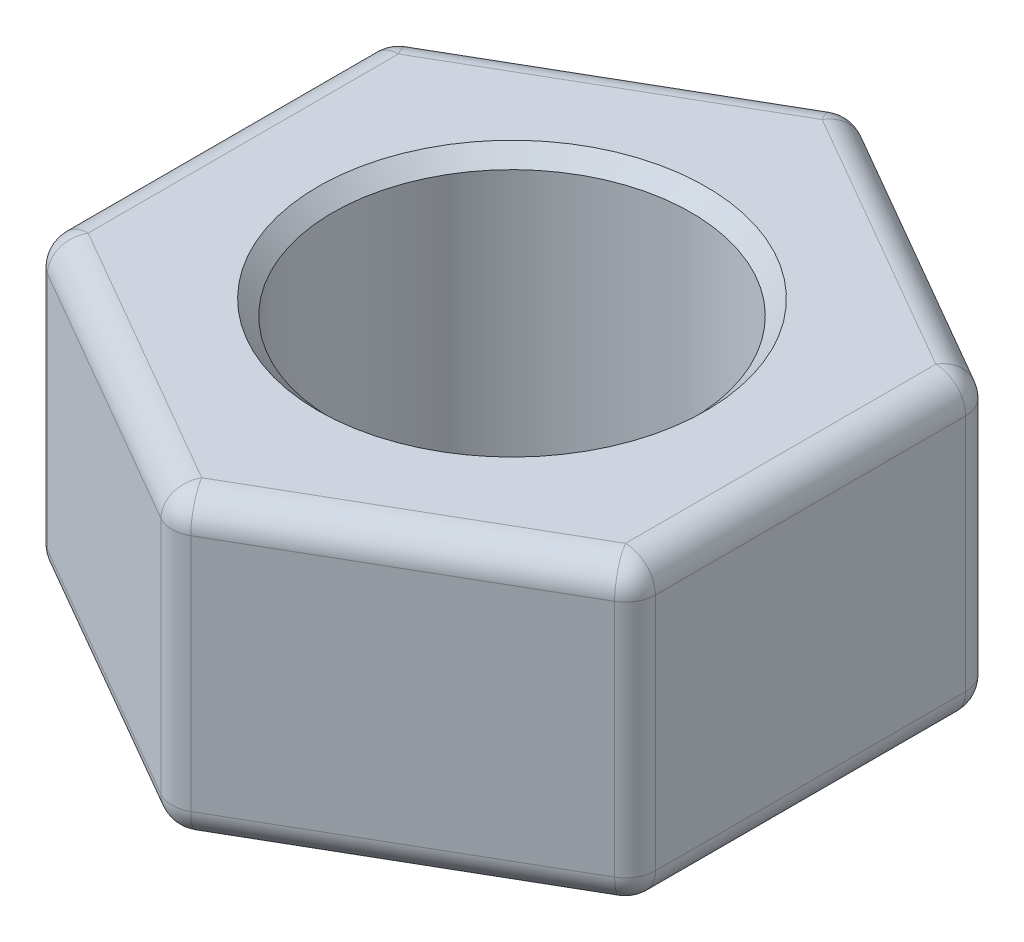
ISO-10303-21;
HEADER;
FILE_DESCRIPTION(('STEP AP214'),'2;1');
FILE_NAME('part.step','',(''),(''),'','','');
FILE_SCHEMA(('AUTOMOTIVE_DESIGN { 1 0 10303 214 1 1 1 1 }'));
ENDSEC;
DATA;
#1=APPLICATION_CONTEXT('core data for automotive mechanical design processes');
#2=APPLICATION_PROTOCOL_DEFINITION('international standard','automotive_design',2000,#1);
#3=PRODUCT_CONTEXT('',#1,'mechanical');
#4=PRODUCT('Part','Part','',(#3));
#5=PRODUCT_RELATED_PRODUCT_CATEGORY('part','',(#4));
#6=PRODUCT_DEFINITION_FORMATION('','',#4);
#7=PRODUCT_DEFINITION_CONTEXT('part definition',#1,'design');
#8=PRODUCT_DEFINITION('design','',#6,#7);
#9=PRODUCT_DEFINITION_SHAPE('','',#8);
#10=(LENGTH_UNIT() NAMED_UNIT(*) SI_UNIT(.MILLI.,.METRE.));
#11=(NAMED_UNIT(*) PLANE_ANGLE_UNIT() SI_UNIT($,.RADIAN.));
#12=(NAMED_UNIT(*) SI_UNIT($,.STERADIAN.) SOLID_ANGLE_UNIT());
#13=UNCERTAINTY_MEASURE_WITH_UNIT(LENGTH_MEASURE(1.E-05),#10,'distance_accuracy_value','');
#14=(GEOMETRIC_REPRESENTATION_CONTEXT(3) GLOBAL_UNCERTAINTY_ASSIGNED_CONTEXT((#13)) GLOBAL_UNIT_ASSIGNED_CONTEXT((#10,
#11,#12)) REPRESENTATION_CONTEXT('',''));
#15=CARTESIAN_POINT('',(0.,0.,0.));
#16=DIRECTION('',(0.,0.,1.));
#17=DIRECTION('',(1.,0.,0.));
#18=AXIS2_PLACEMENT_3D('',#15,#16,#17);
#19=CARTESIAN_POINT('',(0.,5.,0.));
#20=DIRECTION('',(0.,1.,0.));
#21=DIRECTION('',(0.,0.,1.));
#22=AXIS2_PLACEMENT_3D('',#19,#20,#21);
#23=PLANE('',#22);
#24=CARTESIAN_POINT('',(0.,5.,0.));
#25=DIRECTION('',(0.,1.,0.));
#26=DIRECTION('',(0.,0.,1.));
#27=AXIS2_PLACEMENT_3D('',#24,#25,#26);
#28=CIRCLE('',#27,3.25);
#29=CARTESIAN_POINT('',(0.,5.,3.25));
#30=VERTEX_POINT('',#29);
#31=EDGE_CURVE('E11',#30,#30,#28,.F.);
#32=ORIENTED_EDGE('',*,*,#31,.T.);
#33=EDGE_LOOP('',(#32));
#34=FACE_BOUND('',#33,.T.);
#35=DIRECTION('',(-0.866025403784438,0.,0.500000000000001));
#36=VECTOR('',#35,1.);
#37=CARTESIAN_POINT('',(-4.75,5.,-2.45373864405589));
#38=LINE('',#37,#36);
#39=CARTESIAN_POINT('',(0.,5.,-5.19615242270662));
#40=VERTEX_POINT('',#39);
#41=CARTESIAN_POINT('',(-4.5,5.,-2.5980762113533));
#42=VERTEX_POINT('',#41);
#43=EDGE_CURVE('E333',#40,#42,#38,.T.);
#44=ORIENTED_EDGE('',*,*,#43,.T.);
#45=DIRECTION('',(0.,0.,1.));
#46=VECTOR('',#45,1.);
#47=CARTESIAN_POINT('',(-4.49999999999998,5.,2.88675134594815));
#48=LINE('',#47,#46);
#49=CARTESIAN_POINT('',(-4.49999999999998,5.,2.59807621135333));
#50=VERTEX_POINT('',#49);
#51=EDGE_CURVE('E163',#42,#50,#48,.T.);
#52=ORIENTED_EDGE('',*,*,#51,.T.);
#53=DIRECTION('',(0.866025403784442,0.,0.499999999999995));
#54=VECTOR('',#53,1.);
#55=CARTESIAN_POINT('',(0.250000000000038,5.,5.34048999000403));
#56=LINE('',#55,#54);
#57=CARTESIAN_POINT('',(0.,5.,5.19615242270662));
#58=VERTEX_POINT('',#57);
#59=EDGE_CURVE('E158',#50,#58,#56,.T.);
#60=ORIENTED_EDGE('',*,*,#59,.T.);
#61=DIRECTION('',(0.866025403784435,0.,-0.500000000000007));
#62=VECTOR('',#61,1.);
#63=CARTESIAN_POINT('',(4.75000000000002,5.,2.45373864405586));
#64=LINE('',#63,#62);
#65=CARTESIAN_POINT('',(4.50000000000002,5.,2.59807621135327));
#66=VERTEX_POINT('',#65);
#67=EDGE_CURVE('E160',#58,#66,#64,.T.);
#68=ORIENTED_EDGE('',*,*,#67,.T.);
#69=DIRECTION('',(0.,0.,-1.));
#70=VECTOR('',#69,1.);
#71=CARTESIAN_POINT('',(4.49999999999996,5.,-2.88675134594818));
#72=LINE('',#71,#70);
#73=CARTESIAN_POINT('',(4.49999999999996,5.,-2.59807621135337));
#74=VERTEX_POINT('',#73);
#75=EDGE_CURVE('E167',#66,#74,#72,.T.);
#76=ORIENTED_EDGE('',*,*,#75,.T.);
#77=DIRECTION('',(-0.866025403784442,0.,-0.499999999999995));
#78=VECTOR('',#77,1.);
#79=CARTESIAN_POINT('',(-0.249999999999997,5.,-5.34048999000403));
#80=LINE('',#79,#78);
#81=EDGE_CURVE('E464',#74,#40,#80,.T.);
#82=ORIENTED_EDGE('',*,*,#81,.T.);
#83=EDGE_LOOP('',(#44,#52,#60,#68,#76,#82));
#84=FACE_BOUND('',#83,.T.);
#85=ADVANCED_FACE('F33',(#34,#84),#23,.T.);
#86=CARTESIAN_POINT('',(0.,0.,0.));
#87=DIRECTION('',(0.,1.,0.));
#88=DIRECTION('',(0.,0.,1.));
#89=AXIS2_PLACEMENT_3D('',#86,#87,#88);
#90=PLANE('',#89);
#91=CARTESIAN_POINT('',(0.,0.,0.));
#92=DIRECTION('',(0.,1.,0.));
#93=DIRECTION('',(0.,0.,1.));
#94=AXIS2_PLACEMENT_3D('',#91,#92,#93);
#95=CIRCLE('',#94,3.25);
#96=CARTESIAN_POINT('',(0.,0.,3.25));
#97=VERTEX_POINT('',#96);
#98=EDGE_CURVE('E267',#97,#97,#95,.T.);
#99=ORIENTED_EDGE('',*,*,#98,.T.);
#100=EDGE_LOOP('',(#99));
#101=FACE_BOUND('',#100,.T.);
#102=DIRECTION('',(0.866025403784442,0.,0.499999999999995));
#103=VECTOR('',#102,1.);
#104=CARTESIAN_POINT('',(-2.24999999999997,0.,3.89711431702998));
#105=LINE('',#104,#103);
#106=CARTESIAN_POINT('',(0.,0.,5.19615242270662));
#107=VERTEX_POINT('',#106);
#108=CARTESIAN_POINT('',(-4.49999999999998,0.,2.59807621135333));
#109=VERTEX_POINT('',#108);
#110=EDGE_CURVE('E292',#107,#109,#105,.F.);
#111=ORIENTED_EDGE('',*,*,#110,.T.);
#112=DIRECTION('',(0.,0.,1.));
#113=VECTOR('',#112,1.);
#114=CARTESIAN_POINT('',(-4.49999999999999,0.,0.));
#115=LINE('',#114,#113);
#116=CARTESIAN_POINT('',(-4.5,0.,-2.5980762113533));
#117=VERTEX_POINT('',#116);
#118=EDGE_CURVE('E294',#109,#117,#115,.F.);
#119=ORIENTED_EDGE('',*,*,#118,.T.);
#120=DIRECTION('',(-0.866025403784438,0.,0.500000000000001));
#121=VECTOR('',#120,1.);
#122=CARTESIAN_POINT('',(-2.25,0.,-3.89711431702996));
#123=LINE('',#122,#121);
#124=CARTESIAN_POINT('',(0.,0.,-5.19615242270662));
#125=VERTEX_POINT('',#124);
#126=EDGE_CURVE('E310',#117,#125,#123,.F.);
#127=ORIENTED_EDGE('',*,*,#126,.T.);
#128=DIRECTION('',(-0.866025403784442,0.,-0.499999999999995));
#129=VECTOR('',#128,1.);
#130=CARTESIAN_POINT('',(2.24999999999998,0.,-3.89711431703));
#131=LINE('',#130,#129);
#132=CARTESIAN_POINT('',(4.49999999999996,0.,-2.59807621135337));
#133=VERTEX_POINT('',#132);
#134=EDGE_CURVE('E342',#125,#133,#131,.F.);
#135=ORIENTED_EDGE('',*,*,#134,.T.);
#136=DIRECTION('',(0.,0.,-1.));
#137=VECTOR('',#136,1.);
#138=CARTESIAN_POINT('',(4.49999999999999,0.,0.));
#139=LINE('',#138,#137);
#140=CARTESIAN_POINT('',(4.50000000000002,0.,2.59807621135327));
#141=VERTEX_POINT('',#140);
#142=EDGE_CURVE('E300',#133,#141,#139,.F.);
#143=ORIENTED_EDGE('',*,*,#142,.T.);
#144=DIRECTION('',(0.866025403784435,0.,-0.500000000000007));
#145=VECTOR('',#144,1.);
#146=CARTESIAN_POINT('',(2.25000000000003,0.,3.89711431702995));
#147=LINE('',#146,#145);
#148=EDGE_CURVE('E296',#141,#107,#147,.F.);
#149=ORIENTED_EDGE('',*,*,#148,.T.);
#150=EDGE_LOOP('',(#111,#119,#127,#135,#143,#149));
#151=FACE_BOUND('',#150,.T.);
#152=ADVANCED_FACE('F285',(#101,#151),#90,.F.);
#153=CARTESIAN_POINT('',(4.99999999999996,5.,-2.88675134594818));
#154=DIRECTION('',(-0.499999999999995,0.,0.866025403784442));
#155=DIRECTION('',(0.866025403784442,0.,0.499999999999995));
#156=AXIS2_PLACEMENT_3D('',#153,#154,#155);
#157=PLANE('',#156);
#158=DIRECTION('',(0.,-1.,0.));
#159=VECTOR('',#158,1.);
#160=CARTESIAN_POINT('',(0.249999999999999,5.,-5.62916512459884));
#161=LINE('',#160,#159);
#162=CARTESIAN_POINT('',(0.249999999999999,0.5,-5.62916512459884));
#163=VERTEX_POINT('',#162);
#164=CARTESIAN_POINT('',(0.249999999999999,4.5,-5.62916512459884));
#165=VERTEX_POINT('',#164);
#166=EDGE_CURVE('E357',#163,#165,#161,.F.);
#167=ORIENTED_EDGE('',*,*,#166,.T.);
#168=DIRECTION('',(-0.866025403784442,0.,-0.499999999999995));
#169=VECTOR('',#168,1.);
#170=CARTESIAN_POINT('',(4.99999999999996,4.5,-2.88675134594818));
#171=LINE('',#170,#169);
#172=CARTESIAN_POINT('',(4.74999999999996,4.5,-3.03108891324559));
#173=VERTEX_POINT('',#172);
#174=EDGE_CURVE('E359',#165,#173,#171,.F.);
#175=ORIENTED_EDGE('',*,*,#174,.T.);
#176=DIRECTION('',(0.,-1.,0.));
#177=VECTOR('',#176,1.);
#178=CARTESIAN_POINT('',(4.74999999999996,5.,-3.03108891324559));
#179=LINE('',#178,#177);
#180=CARTESIAN_POINT('',(4.74999999999996,0.5,-3.03108891324559));
#181=VERTEX_POINT('',#180);
#182=EDGE_CURVE('E353',#173,#181,#179,.T.);
#183=ORIENTED_EDGE('',*,*,#182,.T.);
#184=DIRECTION('',(-0.866025403784442,0.,-0.499999999999995));
#185=VECTOR('',#184,1.);
#186=CARTESIAN_POINT('',(4.99999999999996,0.5,-2.88675134594818));
#187=LINE('',#186,#185);
#188=EDGE_CURVE('E355',#181,#163,#187,.T.);
#189=ORIENTED_EDGE('',*,*,#188,.T.);
#190=EDGE_LOOP('',(#167,#175,#183,#189));
#191=FACE_BOUND('',#190,.T.);
#192=ADVANCED_FACE('F288',(#191),#157,.F.);
#193=CARTESIAN_POINT('',(0.,5.,-5.77350269189625));
#194=DIRECTION('',(0.500000000000001,0.,0.866025403784438));
#195=DIRECTION('',(0.866025403784438,0.,-0.500000000000001));
#196=AXIS2_PLACEMENT_3D('',#193,#194,#195);
#197=PLANE('',#196);
#198=DIRECTION('',(0.,-1.,0.));
#199=VECTOR('',#198,1.);
#200=CARTESIAN_POINT('',(-4.75,5.,-3.03108891324552));
#201=LINE('',#200,#199);
#202=CARTESIAN_POINT('',(-4.75,0.5,-3.03108891324552));
#203=VERTEX_POINT('',#202);
#204=CARTESIAN_POINT('',(-4.75,4.5,-3.03108891324552));
#205=VERTEX_POINT('',#204);
#206=EDGE_CURVE('E348',#203,#205,#201,.F.);
#207=ORIENTED_EDGE('',*,*,#206,.T.);
#208=DIRECTION('',(-0.866025403784438,0.,0.500000000000001));
#209=VECTOR('',#208,1.);
#210=CARTESIAN_POINT('',(0.,4.5,-5.77350269189625));
#211=LINE('',#210,#209);
#212=CARTESIAN_POINT('',(-0.249999999999998,4.5,-5.62916512459884));
#213=VERTEX_POINT('',#212);
#214=EDGE_CURVE('E350',#205,#213,#211,.F.);
#215=ORIENTED_EDGE('',*,*,#214,.T.);
#216=DIRECTION('',(0.,-1.,0.));
#217=VECTOR('',#216,1.);
#218=CARTESIAN_POINT('',(-0.249999999999998,5.,-5.62916512459884));
#219=LINE('',#218,#217);
#220=CARTESIAN_POINT('',(-0.249999999999998,0.5,-5.62916512459884));
#221=VERTEX_POINT('',#220);
#222=EDGE_CURVE('E309',#213,#221,#219,.T.);
#223=ORIENTED_EDGE('',*,*,#222,.T.);
#224=DIRECTION('',(-0.866025403784438,0.,0.500000000000001));
#225=VECTOR('',#224,1.);
#226=CARTESIAN_POINT('',(0.,0.5,-5.77350269189625));
#227=LINE('',#226,#225);
#228=EDGE_CURVE('E346',#221,#203,#227,.T.);
#229=ORIENTED_EDGE('',*,*,#228,.T.);
#230=EDGE_LOOP('',(#207,#215,#223,#229));
#231=FACE_BOUND('',#230,.T.);
#232=ADVANCED_FACE('F436',(#231),#197,.F.);
#233=CARTESIAN_POINT('',(-5.,5.,-2.88675134594811));
#234=DIRECTION('',(1.,0.,0.));
#235=DIRECTION('',(0.,0.,-1.));
#236=AXIS2_PLACEMENT_3D('',#233,#234,#235);
#237=PLANE('',#236);
#238=DIRECTION('',(0.,0.,1.));
#239=VECTOR('',#238,1.);
#240=CARTESIAN_POINT('',(-5.,4.5,-2.88675134594811));
#241=LINE('',#240,#239);
#242=CARTESIAN_POINT('',(-4.99999999999998,4.5,2.59807621135333));
#243=VERTEX_POINT('',#242);
#244=CARTESIAN_POINT('',(-5.,4.5,-2.5980762113533));
#245=VERTEX_POINT('',#244);
#246=EDGE_CURVE('E331',#243,#245,#241,.F.);
#247=ORIENTED_EDGE('',*,*,#246,.T.);
#248=DIRECTION('',(0.,-1.,0.));
#249=VECTOR('',#248,1.);
#250=CARTESIAN_POINT('',(-5.,5.,-2.5980762113533));
#251=LINE('',#250,#249);
#252=CARTESIAN_POINT('',(-5.,0.5,-2.5980762113533));
#253=VERTEX_POINT('',#252);
#254=EDGE_CURVE('E338',#245,#253,#251,.T.);
#255=ORIENTED_EDGE('',*,*,#254,.T.);
#256=DIRECTION('',(0.,0.,1.));
#257=VECTOR('',#256,1.);
#258=CARTESIAN_POINT('',(-5.,0.5,-2.88675134594811));
#259=LINE('',#258,#257);
#260=CARTESIAN_POINT('',(-4.99999999999998,0.5,2.59807621135333));
#261=VERTEX_POINT('',#260);
#262=EDGE_CURVE('E329',#253,#261,#259,.T.);
#263=ORIENTED_EDGE('',*,*,#262,.T.);
#264=DIRECTION('',(0.,-1.,0.));
#265=VECTOR('',#264,1.);
#266=CARTESIAN_POINT('',(-4.99999999999998,5.,2.59807621135333));
#267=LINE('',#266,#265);
#268=EDGE_CURVE('E322',#261,#243,#267,.F.);
#269=ORIENTED_EDGE('',*,*,#268,.T.);
#270=EDGE_LOOP('',(#247,#255,#263,#269));
#271=FACE_BOUND('',#270,.T.);
#272=ADVANCED_FACE('F403',(#271),#237,.F.);
#273=CARTESIAN_POINT('',(-4.99999999999998,5.,2.88675134594815));
#274=DIRECTION('',(0.499999999999995,0.,-0.866025403784442));
#275=DIRECTION('',(-0.866025403784442,0.,-0.499999999999995));
#276=AXIS2_PLACEMENT_3D('',#273,#274,#275);
#277=PLANE('',#276);
#278=DIRECTION('',(0.866025403784442,0.,0.499999999999995));
#279=VECTOR('',#278,1.);
#280=CARTESIAN_POINT('',(-4.99999999999998,4.5,2.88675134594815));
#281=LINE('',#280,#279);
#282=CARTESIAN_POINT('',(-0.249999999999961,4.5,5.62916512459884));
#283=VERTEX_POINT('',#282);
#284=CARTESIAN_POINT('',(-4.74999999999998,4.5,3.03108891324555));
#285=VERTEX_POINT('',#284);
#286=EDGE_CURVE('E190',#283,#285,#281,.F.);
#287=ORIENTED_EDGE('',*,*,#286,.T.);
#288=DIRECTION('',(0.,-1.,0.));
#289=VECTOR('',#288,1.);
#290=CARTESIAN_POINT('',(-4.74999999999998,5.,3.03108891324555));
#291=LINE('',#290,#289);
#292=CARTESIAN_POINT('',(-4.74999999999998,0.5,3.03108891324555));
#293=VERTEX_POINT('',#292);
#294=EDGE_CURVE('E375',#285,#293,#291,.T.);
#295=ORIENTED_EDGE('',*,*,#294,.T.);
#296=DIRECTION('',(0.866025403784442,0.,0.499999999999995));
#297=VECTOR('',#296,1.);
#298=CARTESIAN_POINT('',(-4.99999999999998,0.5,2.88675134594815));
#299=LINE('',#298,#297);
#300=CARTESIAN_POINT('',(-0.249999999999961,0.5,5.62916512459884));
#301=VERTEX_POINT('',#300);
#302=EDGE_CURVE('E314',#293,#301,#299,.T.);
#303=ORIENTED_EDGE('',*,*,#302,.T.);
#304=DIRECTION('',(0.,-1.,0.));
#305=VECTOR('',#304,1.);
#306=CARTESIAN_POINT('',(-0.249999999999961,5.,5.62916512459884));
#307=LINE('',#306,#305);
#308=EDGE_CURVE('E371',#301,#283,#307,.F.);
#309=ORIENTED_EDGE('',*,*,#308,.T.);
#310=EDGE_LOOP('',(#287,#295,#303,#309));
#311=FACE_BOUND('',#310,.T.);
#312=ADVANCED_FACE('F430',(#311),#277,.F.);
#313=CARTESIAN_POINT('',(0.,5.,5.77350269189625));
#314=DIRECTION('',(-0.500000000000007,0.,-0.866025403784434));
#315=DIRECTION('',(-0.866025403784435,0.,0.500000000000007));
#316=AXIS2_PLACEMENT_3D('',#313,#314,#315);
#317=PLANE('',#316);
#318=DIRECTION('',(0.866025403784435,0.,-0.500000000000007));
#319=VECTOR('',#318,1.);
#320=CARTESIAN_POINT('',(0.,4.5,5.77350269189625));
#321=LINE('',#320,#319);
#322=CARTESIAN_POINT('',(4.75000000000002,4.5,3.03108891324549));
#323=VERTEX_POINT('',#322);
#324=CARTESIAN_POINT('',(0.25000000000004,4.5,5.62916512459884));
#325=VERTEX_POINT('',#324);
#326=EDGE_CURVE('E48',#323,#325,#321,.F.);
#327=ORIENTED_EDGE('',*,*,#326,.T.);
#328=DIRECTION('',(0.,-1.,0.));
#329=VECTOR('',#328,1.);
#330=CARTESIAN_POINT('',(0.25000000000004,5.,5.62916512459884));
#331=LINE('',#330,#329);
#332=CARTESIAN_POINT('',(0.25000000000004,0.5,5.62916512459884));
#333=VERTEX_POINT('',#332);
#334=EDGE_CURVE('E271',#325,#333,#331,.T.);
#335=ORIENTED_EDGE('',*,*,#334,.T.);
#336=DIRECTION('',(0.866025403784435,0.,-0.500000000000007));
#337=VECTOR('',#336,1.);
#338=CARTESIAN_POINT('',(0.,0.5,5.77350269189625));
#339=LINE('',#338,#337);
#340=CARTESIAN_POINT('',(4.75000000000002,0.5,3.03108891324549));
#341=VERTEX_POINT('',#340);
#342=EDGE_CURVE('E377',#333,#341,#339,.T.);
#343=ORIENTED_EDGE('',*,*,#342,.T.);
#344=DIRECTION('',(0.,-1.,0.));
#345=VECTOR('',#344,1.);
#346=CARTESIAN_POINT('',(4.75000000000002,5.,3.03108891324549));
#347=LINE('',#346,#345);
#348=EDGE_CURVE('E53',#341,#323,#347,.F.);
#349=ORIENTED_EDGE('',*,*,#348,.T.);
#350=EDGE_LOOP('',(#327,#335,#343,#349));
#351=FACE_BOUND('',#350,.T.);
#352=ADVANCED_FACE('F426',(#351),#317,.F.);
#353=CARTESIAN_POINT('',(5.00000000000002,5.,2.88675134594808));
#354=DIRECTION('',(-1.,0.,0.));
#355=DIRECTION('',(0.,0.,1.));
#356=AXIS2_PLACEMENT_3D('',#353,#354,#355);
#357=PLANE('',#356);
#358=DIRECTION('',(0.,-1.,0.));
#359=VECTOR('',#358,1.);
#360=CARTESIAN_POINT('',(4.99999999999996,5.,-2.59807621135337));
#361=LINE('',#360,#359);
#362=CARTESIAN_POINT('',(4.99999999999996,0.5,-2.59807621135337));
#363=VERTEX_POINT('',#362);
#364=CARTESIAN_POINT('',(4.99999999999996,4.5,-2.59807621135337));
#365=VERTEX_POINT('',#364);
#366=EDGE_CURVE('E366',#363,#365,#361,.F.);
#367=ORIENTED_EDGE('',*,*,#366,.T.);
#368=DIRECTION('',(0.,0.,-1.));
#369=VECTOR('',#368,1.);
#370=CARTESIAN_POINT('',(5.00000000000002,4.5,2.88675134594808));
#371=LINE('',#370,#369);
#372=CARTESIAN_POINT('',(5.00000000000002,4.5,2.59807621135326));
#373=VERTEX_POINT('',#372);
#374=EDGE_CURVE('E368',#365,#373,#371,.F.);
#375=ORIENTED_EDGE('',*,*,#374,.T.);
#376=DIRECTION('',(0.,-1.,0.));
#377=VECTOR('',#376,1.);
#378=CARTESIAN_POINT('',(5.00000000000002,5.,2.59807621135326));
#379=LINE('',#378,#377);
#380=CARTESIAN_POINT('',(5.00000000000002,0.5,2.59807621135326));
#381=VERTEX_POINT('',#380);
#382=EDGE_CURVE('E362',#373,#381,#379,.T.);
#383=ORIENTED_EDGE('',*,*,#382,.T.);
#384=DIRECTION('',(0.,0.,-1.));
#385=VECTOR('',#384,1.);
#386=CARTESIAN_POINT('',(5.00000000000002,0.5,2.88675134594808));
#387=LINE('',#386,#385);
#388=EDGE_CURVE('E364',#381,#363,#387,.T.);
#389=ORIENTED_EDGE('',*,*,#388,.T.);
#390=EDGE_LOOP('',(#367,#375,#383,#389));
#391=FACE_BOUND('',#390,.T.);
#392=ADVANCED_FACE('F423',(#391),#357,.F.);
#393=CARTESIAN_POINT('',(0.,5.,0.));
#394=DIRECTION('',(0.,-1.,0.));
#395=DIRECTION('',(0.,0.,-1.));
#396=AXIS2_PLACEMENT_3D('',#393,#394,#395);
#397=CYLINDRICAL_SURFACE('',#396,3.);
#398=CARTESIAN_POINT('',(0.,0.249999999999999,0.));
#399=DIRECTION('',(0.,1.,0.));
#400=DIRECTION('',(0.,0.,1.));
#401=AXIS2_PLACEMENT_3D('',#398,#399,#400);
#402=CIRCLE('',#401,3.);
#403=CARTESIAN_POINT('',(0.,0.249999999999999,3.));
#404=VERTEX_POINT('',#403);
#405=EDGE_CURVE('E41',#404,#404,#402,.F.);
#406=ORIENTED_EDGE('',*,*,#405,.T.);
#407=EDGE_LOOP('',(#406));
#408=FACE_BOUND('',#407,.T.);
#409=CARTESIAN_POINT('',(0.,4.75,0.));
#410=DIRECTION('',(0.,1.,0.));
#411=DIRECTION('',(0.,0.,1.));
#412=AXIS2_PLACEMENT_3D('',#409,#410,#411);
#413=CIRCLE('',#412,3.);
#414=CARTESIAN_POINT('',(0.,4.75,3.));
#415=VERTEX_POINT('',#414);
#416=EDGE_CURVE('E270',#415,#415,#413,.T.);
#417=ORIENTED_EDGE('',*,*,#416,.T.);
#418=EDGE_LOOP('',(#417));
#419=FACE_BOUND('',#418,.T.);
#420=ADVANCED_FACE('F276',(#408,#419),#397,.F.);
#421=CARTESIAN_POINT('',(4.50000000000002,0.5,2.88675134594808));
#422=DIRECTION('',(0.,0.,-1.));
#423=DIRECTION('',(-1.,0.,0.));
#424=AXIS2_PLACEMENT_3D('',#421,#422,#423);
#425=CYLINDRICAL_SURFACE('',#424,0.5);
#426=CARTESIAN_POINT('',(4.49999999999996,0.5,-2.59807621135337));
#427=DIRECTION('',(0.,0.,-1.));
#428=DIRECTION('',(-1.,0.,0.));
#429=AXIS2_PLACEMENT_3D('',#426,#427,#428);
#430=CIRCLE('',#429,0.5);
#431=EDGE_CURVE('E178',#363,#133,#430,.T.);
#432=ORIENTED_EDGE('',*,*,#431,.F.);
#433=ORIENTED_EDGE('',*,*,#388,.F.);
#434=CARTESIAN_POINT('',(4.50000000000002,0.5,2.59807621135327));
#435=DIRECTION('',(0.,0.,1.));
#436=DIRECTION('',(1.,0.,0.));
#437=AXIS2_PLACEMENT_3D('',#434,#435,#436);
#438=CIRCLE('',#437,0.5);
#439=EDGE_CURVE('E262',#141,#381,#438,.T.);
#440=ORIENTED_EDGE('',*,*,#439,.F.);
#441=ORIENTED_EDGE('',*,*,#142,.F.);
#442=EDGE_LOOP('',(#432,#433,#440,#441));
#443=FACE_BOUND('',#442,.T.);
#444=ADVANCED_FACE('F553',(#443),#425,.T.);
#445=CARTESIAN_POINT('',(4.49999999999996,0.5,-2.59807621135337));
#446=DIRECTION('',(0.,0.,1.));
#447=DIRECTION('',(1.,0.,0.));
#448=AXIS2_PLACEMENT_3D('',#445,#446,#447);
#449=SPHERICAL_SURFACE('',#448,0.5);
#450=CARTESIAN_POINT('',(4.49999999999996,0.5,-2.59807621135337));
#451=DIRECTION('',(0.,-1.,0.));
#452=DIRECTION('',(0.,0.,-1.));
#453=AXIS2_PLACEMENT_3D('',#450,#451,#452);
#454=CIRCLE('',#453,0.5);
#455=EDGE_CURVE('E256',#363,#181,#454,.F.);
#456=ORIENTED_EDGE('',*,*,#455,.F.);
#457=ORIENTED_EDGE('',*,*,#431,.T.);
#458=CARTESIAN_POINT('',(4.49999999999996,0.5,-2.59807621135337));
#459=DIRECTION('',(0.86602540378444,0.,0.499999999999997));
#460=DIRECTION('',(0.499999999999997,0.,-0.866025403784441));
#461=AXIS2_PLACEMENT_3D('',#458,#459,#460);
#462=CIRCLE('',#461,0.5);
#463=EDGE_CURVE('E259',#181,#133,#462,.F.);
#464=ORIENTED_EDGE('',*,*,#463,.F.);
#465=EDGE_LOOP('',(#456,#457,#464));
#466=FACE_BOUND('',#465,.T.);
#467=ADVANCED_FACE('F482',(#466),#449,.T.);
#468=CARTESIAN_POINT('',(4.50000000000002,0.5,2.59807621135327));
#469=DIRECTION('',(0.,0.,1.));
#470=DIRECTION('',(1.,0.,0.));
#471=AXIS2_PLACEMENT_3D('',#468,#469,#470);
#472=SPHERICAL_SURFACE('',#471,0.5);
#473=CARTESIAN_POINT('',(4.50000000000002,0.5,2.59807621135327));
#474=DIRECTION('',(0.866025403784434,0.,-0.500000000000007));
#475=DIRECTION('',(-0.500000000000007,0.,-0.866025403784435));
#476=AXIS2_PLACEMENT_3D('',#473,#474,#475);
#477=CIRCLE('',#476,0.5);
#478=EDGE_CURVE('E250',#141,#341,#477,.F.);
#479=ORIENTED_EDGE('',*,*,#478,.F.);
#480=ORIENTED_EDGE('',*,*,#439,.T.);
#481=CARTESIAN_POINT('',(4.50000000000002,0.5,2.59807621135327));
#482=DIRECTION('',(0.,-1.,0.));
#483=DIRECTION('',(0.,0.,-1.));
#484=AXIS2_PLACEMENT_3D('',#481,#482,#483);
#485=CIRCLE('',#484,0.5);
#486=EDGE_CURVE('E253',#341,#381,#485,.F.);
#487=ORIENTED_EDGE('',*,*,#486,.F.);
#488=EDGE_LOOP('',(#479,#480,#487));
#489=FACE_BOUND('',#488,.T.);
#490=ADVANCED_FACE('F547',(#489),#472,.T.);
#491=CARTESIAN_POINT('',(4.74999999999996,0.5,-2.45373864405596));
#492=DIRECTION('',(-0.866025403784442,0.,-0.499999999999995));
#493=DIRECTION('',(-0.499999999999995,0.,0.866025403784442));
#494=AXIS2_PLACEMENT_3D('',#491,#492,#493);
#495=CYLINDRICAL_SURFACE('',#494,0.5);
#496=ORIENTED_EDGE('',*,*,#463,.T.);
#497=ORIENTED_EDGE('',*,*,#134,.F.);
#498=CARTESIAN_POINT('',(0.,0.5,-5.19615242270662));
#499=DIRECTION('',(-0.866025403784441,0.,-0.499999999999995));
#500=DIRECTION('',(-0.499999999999995,0.,0.866025403784441));
#501=AXIS2_PLACEMENT_3D('',#498,#499,#500);
#502=CIRCLE('',#501,0.5);
#503=EDGE_CURVE('E247',#163,#125,#502,.T.);
#504=ORIENTED_EDGE('',*,*,#503,.F.);
#505=ORIENTED_EDGE('',*,*,#188,.F.);
#506=EDGE_LOOP('',(#496,#497,#504,#505));
#507=FACE_BOUND('',#506,.T.);
#508=ADVANCED_FACE('F486',(#507),#495,.T.);
#509=CARTESIAN_POINT('',(4.49999999999996,5.,-2.59807621135337));
#510=DIRECTION('',(0.,-1.,0.));
#511=DIRECTION('',(0.,0.,-1.));
#512=AXIS2_PLACEMENT_3D('',#509,#510,#511);
#513=CYLINDRICAL_SURFACE('',#512,0.5);
#514=ORIENTED_EDGE('',*,*,#455,.T.);
#515=ORIENTED_EDGE('',*,*,#182,.F.);
#516=CARTESIAN_POINT('',(4.49999999999996,4.5,-2.59807621135337));
#517=DIRECTION('',(0.,1.,0.));
#518=DIRECTION('',(0.,0.,1.));
#519=AXIS2_PLACEMENT_3D('',#516,#517,#518);
#520=CIRCLE('',#519,0.5);
#521=EDGE_CURVE('E244',#365,#173,#520,.T.);
#522=ORIENTED_EDGE('',*,*,#521,.F.);
#523=ORIENTED_EDGE('',*,*,#366,.F.);
#524=EDGE_LOOP('',(#514,#515,#522,#523));
#525=FACE_BOUND('',#524,.T.);
#526=ADVANCED_FACE('F478',(#525),#513,.T.);
#527=CARTESIAN_POINT('',(4.49999999999999,4.5,0.));
#528=DIRECTION('',(0.,0.,1.));
#529=DIRECTION('',(1.,0.,0.));
#530=AXIS2_PLACEMENT_3D('',#527,#528,#529);
#531=CYLINDRICAL_SURFACE('',#530,0.5);
#532=CARTESIAN_POINT('',(4.50000000000002,4.5,2.59807621135327));
#533=DIRECTION('',(0.,0.,1.));
#534=DIRECTION('',(1.,0.,0.));
#535=AXIS2_PLACEMENT_3D('',#532,#533,#534);
#536=CIRCLE('',#535,0.5);
#537=EDGE_CURVE('E238',#373,#66,#536,.T.);
#538=ORIENTED_EDGE('',*,*,#537,.F.);
#539=ORIENTED_EDGE('',*,*,#374,.F.);
#540=CARTESIAN_POINT('',(4.49999999999996,4.5,-2.59807621135337));
#541=DIRECTION('',(0.,0.,-1.));
#542=DIRECTION('',(-1.,0.,0.));
#543=AXIS2_PLACEMENT_3D('',#540,#541,#542);
#544=CIRCLE('',#543,0.5);
#545=EDGE_CURVE('E241',#74,#365,#544,.T.);
#546=ORIENTED_EDGE('',*,*,#545,.F.);
#547=ORIENTED_EDGE('',*,*,#75,.F.);
#548=EDGE_LOOP('',(#538,#539,#546,#547));
#549=FACE_BOUND('',#548,.T.);
#550=ADVANCED_FACE('F471',(#549),#531,.T.);
#551=CARTESIAN_POINT('',(4.50000000000002,5.,2.59807621135327));
#552=DIRECTION('',(0.,-1.,0.));
#553=DIRECTION('',(0.,0.,-1.));
#554=AXIS2_PLACEMENT_3D('',#551,#552,#553);
#555=CYLINDRICAL_SURFACE('',#554,0.5);
#556=ORIENTED_EDGE('',*,*,#486,.T.);
#557=ORIENTED_EDGE('',*,*,#382,.F.);
#558=CARTESIAN_POINT('',(4.50000000000002,4.5,2.59807621135327));
#559=DIRECTION('',(0.,1.,0.));
#560=DIRECTION('',(0.,0.,1.));
#561=AXIS2_PLACEMENT_3D('',#558,#559,#560);
#562=CIRCLE('',#561,0.5);
#563=EDGE_CURVE('E236',#323,#373,#562,.T.);
#564=ORIENTED_EDGE('',*,*,#563,.F.);
#565=ORIENTED_EDGE('',*,*,#348,.F.);
#566=EDGE_LOOP('',(#556,#557,#564,#565));
#567=FACE_BOUND('',#566,.T.);
#568=ADVANCED_FACE('F536',(#567),#555,.T.);
#569=CARTESIAN_POINT('',(-0.249999999999963,0.5,5.34048999000403));
#570=DIRECTION('',(0.866025403784435,0.,-0.500000000000007));
#571=DIRECTION('',(-0.500000000000007,0.,-0.866025403784434));
#572=AXIS2_PLACEMENT_3D('',#569,#570,#571);
#573=CYLINDRICAL_SURFACE('',#572,0.5);
#574=ORIENTED_EDGE('',*,*,#478,.T.);
#575=ORIENTED_EDGE('',*,*,#342,.F.);
#576=CARTESIAN_POINT('',(0.,0.5,5.19615242270662));
#577=DIRECTION('',(-0.866025403784434,0.,0.500000000000007));
#578=DIRECTION('',(0.500000000000007,0.,0.866025403784434));
#579=AXIS2_PLACEMENT_3D('',#576,#577,#578);
#580=CIRCLE('',#579,0.5);
#581=EDGE_CURVE('E233',#107,#333,#580,.T.);
#582=ORIENTED_EDGE('',*,*,#581,.F.);
#583=ORIENTED_EDGE('',*,*,#148,.F.);
#584=EDGE_LOOP('',(#574,#575,#582,#583));
#585=FACE_BOUND('',#584,.T.);
#586=ADVANCED_FACE('F533',(#585),#573,.T.);
#587=CARTESIAN_POINT('',(0.,0.5,-5.19615242270662));
#588=DIRECTION('',(0.,0.,1.));
#589=DIRECTION('',(1.,0.,0.));
#590=AXIS2_PLACEMENT_3D('',#587,#588,#589);
#591=SPHERICAL_SURFACE('',#590,0.5);
#592=CARTESIAN_POINT('',(0.,0.5,-5.19615242270662));
#593=DIRECTION('',(0.,-1.,0.));
#594=DIRECTION('',(0.,0.,-1.));
#595=AXIS2_PLACEMENT_3D('',#592,#593,#594);
#596=CIRCLE('',#595,0.5);
#597=EDGE_CURVE('E227',#163,#221,#596,.F.);
#598=ORIENTED_EDGE('',*,*,#597,.F.);
#599=ORIENTED_EDGE('',*,*,#503,.T.);
#600=CARTESIAN_POINT('',(0.,0.5,-5.19615242270662));
#601=DIRECTION('',(0.866025403784438,0.,-0.500000000000001));
#602=DIRECTION('',(-0.500000000000001,0.,-0.866025403784438));
#603=AXIS2_PLACEMENT_3D('',#600,#601,#602);
#604=CIRCLE('',#603,0.5);
#605=EDGE_CURVE('E230',#221,#125,#604,.F.);
#606=ORIENTED_EDGE('',*,*,#605,.F.);
#607=EDGE_LOOP('',(#598,#599,#606));
#608=FACE_BOUND('',#607,.T.);
#609=ADVANCED_FACE('F490',(#608),#591,.T.);
#610=CARTESIAN_POINT('',(4.49999999999996,4.5,-2.59807621135337));
#611=DIRECTION('',(0.,0.,1.));
#612=DIRECTION('',(1.,0.,0.));
#613=AXIS2_PLACEMENT_3D('',#610,#611,#612);
#614=SPHERICAL_SURFACE('',#613,0.5);
#615=ORIENTED_EDGE('',*,*,#545,.T.);
#616=ORIENTED_EDGE('',*,*,#521,.T.);
#617=CARTESIAN_POINT('',(4.49999999999996,4.5,-2.59807621135337));
#618=DIRECTION('',(0.866025403784441,0.,0.499999999999995));
#619=DIRECTION('',(0.499999999999995,0.,-0.866025403784442));
#620=AXIS2_PLACEMENT_3D('',#617,#618,#619);
#621=CIRCLE('',#620,0.5);
#622=EDGE_CURVE('E225',#74,#173,#621,.F.);
#623=ORIENTED_EDGE('',*,*,#622,.F.);
#624=EDGE_LOOP('',(#615,#616,#623));
#625=FACE_BOUND('',#624,.T.);
#626=ADVANCED_FACE('F474',(#625),#614,.T.);
#627=CARTESIAN_POINT('',(4.50000000000002,4.5,2.59807621135327));
#628=DIRECTION('',(0.,0.,1.));
#629=DIRECTION('',(1.,0.,0.));
#630=AXIS2_PLACEMENT_3D('',#627,#628,#629);
#631=SPHERICAL_SURFACE('',#630,0.5);
#632=ORIENTED_EDGE('',*,*,#563,.T.);
#633=ORIENTED_EDGE('',*,*,#537,.T.);
#634=CARTESIAN_POINT('',(4.50000000000002,4.5,2.59807621135327));
#635=DIRECTION('',(0.866025403784434,0.,-0.500000000000008));
#636=DIRECTION('',(-0.500000000000008,0.,-0.866025403784434));
#637=AXIS2_PLACEMENT_3D('',#634,#635,#636);
#638=CIRCLE('',#637,0.5);
#639=EDGE_CURVE('E177',#323,#66,#638,.F.);
#640=ORIENTED_EDGE('',*,*,#639,.F.);
#641=EDGE_LOOP('',(#632,#633,#640));
#642=FACE_BOUND('',#641,.T.);
#643=ADVANCED_FACE('F524',(#642),#631,.T.);
#644=CARTESIAN_POINT('',(0.,0.5,5.19615242270662));
#645=DIRECTION('',(0.,0.,1.));
#646=DIRECTION('',(1.,0.,0.));
#647=AXIS2_PLACEMENT_3D('',#644,#645,#646);
#648=SPHERICAL_SURFACE('',#647,0.5);
#649=CARTESIAN_POINT('',(0.,0.5,5.19615242270662));
#650=DIRECTION('',(0.866025403784441,0.,0.499999999999995));
#651=DIRECTION('',(0.499999999999995,0.,-0.866025403784441));
#652=AXIS2_PLACEMENT_3D('',#649,#650,#651);
#653=CIRCLE('',#652,0.5);
#654=EDGE_CURVE('E219',#107,#301,#653,.F.);
#655=ORIENTED_EDGE('',*,*,#654,.F.);
#656=ORIENTED_EDGE('',*,*,#581,.T.);
#657=CARTESIAN_POINT('',(0.,0.5,5.19615242270662));
#658=DIRECTION('',(0.,-1.,0.));
#659=DIRECTION('',(0.,0.,-1.));
#660=AXIS2_PLACEMENT_3D('',#657,#658,#659);
#661=CIRCLE('',#660,0.5);
#662=EDGE_CURVE('E222',#301,#333,#661,.F.);
#663=ORIENTED_EDGE('',*,*,#662,.F.);
#664=EDGE_LOOP('',(#655,#656,#663));
#665=FACE_BOUND('',#664,.T.);
#666=ADVANCED_FACE('F521',(#665),#648,.T.);
#667=CARTESIAN_POINT('',(0.25,0.5,-5.34048999000403));
#668=DIRECTION('',(-0.866025403784438,0.,0.500000000000001));
#669=DIRECTION('',(0.500000000000001,0.,0.866025403784438));
#670=AXIS2_PLACEMENT_3D('',#667,#668,#669);
#671=CYLINDRICAL_SURFACE('',#670,0.5);
#672=ORIENTED_EDGE('',*,*,#605,.T.);
#673=ORIENTED_EDGE('',*,*,#126,.F.);
#674=CARTESIAN_POINT('',(-4.5,0.5,-2.5980762113533));
#675=DIRECTION('',(-0.866025403784438,0.,0.5));
#676=DIRECTION('',(0.5,0.,0.866025403784438));
#677=AXIS2_PLACEMENT_3D('',#674,#675,#676);
#678=CIRCLE('',#677,0.5);
#679=EDGE_CURVE('E214',#203,#117,#678,.T.);
#680=ORIENTED_EDGE('',*,*,#679,.F.);
#681=ORIENTED_EDGE('',*,*,#228,.F.);
#682=EDGE_LOOP('',(#672,#673,#680,#681));
#683=FACE_BOUND('',#682,.T.);
#684=ADVANCED_FACE('F494',(#683),#671,.T.);
#685=CARTESIAN_POINT('',(0.,5.,-5.19615242270662));
#686=DIRECTION('',(0.,-1.,0.));
#687=DIRECTION('',(0.,0.,-1.));
#688=AXIS2_PLACEMENT_3D('',#685,#686,#687);
#689=CYLINDRICAL_SURFACE('',#688,0.5);
#690=ORIENTED_EDGE('',*,*,#597,.T.);
#691=ORIENTED_EDGE('',*,*,#222,.F.);
#692=CARTESIAN_POINT('',(0.,4.5,-5.19615242270662));
#693=DIRECTION('',(0.,1.,0.));
#694=DIRECTION('',(0.,0.,1.));
#695=AXIS2_PLACEMENT_3D('',#692,#693,#694);
#696=CIRCLE('',#695,0.5);
#697=EDGE_CURVE('E211',#165,#213,#696,.T.);
#698=ORIENTED_EDGE('',*,*,#697,.F.);
#699=ORIENTED_EDGE('',*,*,#166,.F.);
#700=EDGE_LOOP('',(#690,#691,#698,#699));
#701=FACE_BOUND('',#700,.T.);
#702=ADVANCED_FACE('F457',(#701),#689,.T.);
#703=CARTESIAN_POINT('',(2.24999999999998,4.5,-3.89711431703));
#704=DIRECTION('',(0.866025403784442,0.,0.499999999999995));
#705=DIRECTION('',(0.499999999999995,0.,-0.866025403784442));
#706=AXIS2_PLACEMENT_3D('',#703,#704,#705);
#707=CYLINDRICAL_SURFACE('',#706,0.5);
#708=ORIENTED_EDGE('',*,*,#622,.T.);
#709=ORIENTED_EDGE('',*,*,#174,.F.);
#710=CARTESIAN_POINT('',(0.,4.5,-5.19615242270662));
#711=DIRECTION('',(-0.866025403784441,0.,-0.499999999999996));
#712=DIRECTION('',(-0.499999999999996,0.,0.866025403784441));
#713=AXIS2_PLACEMENT_3D('',#710,#711,#712);
#714=CIRCLE('',#713,0.5);
#715=EDGE_CURVE('E187',#40,#165,#714,.T.);
#716=ORIENTED_EDGE('',*,*,#715,.F.);
#717=ORIENTED_EDGE('',*,*,#81,.F.);
#718=EDGE_LOOP('',(#708,#709,#716,#717));
#719=FACE_BOUND('',#718,.T.);
#720=ADVANCED_FACE('F452',(#719),#707,.T.);
#721=CARTESIAN_POINT('',(2.25000000000003,4.5,3.89711431702995));
#722=DIRECTION('',(-0.866025403784435,0.,0.500000000000007));
#723=DIRECTION('',(0.500000000000007,0.,0.866025403784434));
#724=AXIS2_PLACEMENT_3D('',#721,#722,#723);
#725=CYLINDRICAL_SURFACE('',#724,0.5);
#726=ORIENTED_EDGE('',*,*,#639,.T.);
#727=ORIENTED_EDGE('',*,*,#67,.F.);
#728=CARTESIAN_POINT('',(0.,4.5,5.19615242270662));
#729=DIRECTION('',(-0.866025403784434,0.,0.500000000000007));
#730=DIRECTION('',(0.500000000000008,0.,0.866025403784434));
#731=AXIS2_PLACEMENT_3D('',#728,#729,#730);
#732=CIRCLE('',#731,0.5);
#733=EDGE_CURVE('E174',#325,#58,#732,.T.);
#734=ORIENTED_EDGE('',*,*,#733,.F.);
#735=ORIENTED_EDGE('',*,*,#326,.F.);
#736=EDGE_LOOP('',(#726,#727,#734,#735));
#737=FACE_BOUND('',#736,.T.);
#738=ADVANCED_FACE('F173',(#737),#725,.T.);
#739=CARTESIAN_POINT('',(0.,5.,5.19615242270662));
#740=DIRECTION('',(0.,-1.,0.));
#741=DIRECTION('',(0.,0.,-1.));
#742=AXIS2_PLACEMENT_3D('',#739,#740,#741);
#743=CYLINDRICAL_SURFACE('',#742,0.5);
#744=ORIENTED_EDGE('',*,*,#662,.T.);
#745=ORIENTED_EDGE('',*,*,#334,.F.);
#746=CARTESIAN_POINT('',(0.,4.5,5.19615242270662));
#747=DIRECTION('',(0.,1.,0.));
#748=DIRECTION('',(0.,0.,1.));
#749=AXIS2_PLACEMENT_3D('',#746,#747,#748);
#750=CIRCLE('',#749,0.5);
#751=EDGE_CURVE('E186',#283,#325,#750,.T.);
#752=ORIENTED_EDGE('',*,*,#751,.F.);
#753=ORIENTED_EDGE('',*,*,#308,.F.);
#754=EDGE_LOOP('',(#744,#745,#752,#753));
#755=FACE_BOUND('',#754,.T.);
#756=ADVANCED_FACE('F509',(#755),#743,.T.);
#757=CARTESIAN_POINT('',(-4.74999999999998,0.5,2.45373864405593));
#758=DIRECTION('',(0.866025403784442,0.,0.499999999999995));
#759=DIRECTION('',(0.499999999999995,0.,-0.866025403784442));
#760=AXIS2_PLACEMENT_3D('',#757,#758,#759);
#761=CYLINDRICAL_SURFACE('',#760,0.5);
#762=ORIENTED_EDGE('',*,*,#654,.T.);
#763=ORIENTED_EDGE('',*,*,#302,.F.);
#764=CARTESIAN_POINT('',(-4.49999999999998,0.5,2.59807621135333));
#765=DIRECTION('',(-0.866025403784441,0.,-0.499999999999995));
#766=DIRECTION('',(-0.499999999999995,0.,0.866025403784442));
#767=AXIS2_PLACEMENT_3D('',#764,#765,#766);
#768=CIRCLE('',#767,0.5);
#769=EDGE_CURVE('E205',#109,#293,#768,.T.);
#770=ORIENTED_EDGE('',*,*,#769,.F.);
#771=ORIENTED_EDGE('',*,*,#110,.F.);
#772=EDGE_LOOP('',(#762,#763,#770,#771));
#773=FACE_BOUND('',#772,.T.);
#774=ADVANCED_FACE('F313',(#773),#761,.T.);
#775=CARTESIAN_POINT('',(-4.5,0.5,-2.88675134594811));
#776=DIRECTION('',(0.,0.,1.));
#777=DIRECTION('',(1.,0.,0.));
#778=AXIS2_PLACEMENT_3D('',#775,#776,#777);
#779=CYLINDRICAL_SURFACE('',#778,0.5);
#780=CARTESIAN_POINT('',(-4.5,0.5,-2.5980762113533));
#781=DIRECTION('',(0.,0.,-1.));
#782=DIRECTION('',(-1.,0.,0.));
#783=AXIS2_PLACEMENT_3D('',#780,#781,#782);
#784=CIRCLE('',#783,0.5);
#785=EDGE_CURVE('E216',#117,#253,#784,.T.);
#786=ORIENTED_EDGE('',*,*,#785,.F.);
#787=ORIENTED_EDGE('',*,*,#118,.F.);
#788=CARTESIAN_POINT('',(-4.49999999999998,0.5,2.59807621135333));
#789=DIRECTION('',(0.,0.,1.));
#790=DIRECTION('',(1.,0.,0.));
#791=AXIS2_PLACEMENT_3D('',#788,#789,#790);
#792=CIRCLE('',#791,0.5);
#793=EDGE_CURVE('E202',#261,#109,#792,.T.);
#794=ORIENTED_EDGE('',*,*,#793,.F.);
#795=ORIENTED_EDGE('',*,*,#262,.F.);
#796=EDGE_LOOP('',(#786,#787,#794,#795));
#797=FACE_BOUND('',#796,.T.);
#798=ADVANCED_FACE('F305',(#797),#779,.T.);
#799=CARTESIAN_POINT('',(-4.5,0.5,-2.5980762113533));
#800=DIRECTION('',(0.,0.,1.));
#801=DIRECTION('',(1.,0.,0.));
#802=AXIS2_PLACEMENT_3D('',#799,#800,#801);
#803=SPHERICAL_SURFACE('',#802,0.5);
#804=ORIENTED_EDGE('',*,*,#679,.T.);
#805=ORIENTED_EDGE('',*,*,#785,.T.);
#806=CARTESIAN_POINT('',(-4.5,0.5,-2.5980762113533));
#807=DIRECTION('',(0.,-1.,0.));
#808=DIRECTION('',(0.,0.,-1.));
#809=AXIS2_PLACEMENT_3D('',#806,#807,#808);
#810=CIRCLE('',#809,0.5);
#811=EDGE_CURVE('E194',#203,#253,#810,.F.);
#812=ORIENTED_EDGE('',*,*,#811,.F.);
#813=EDGE_LOOP('',(#804,#805,#812));
#814=FACE_BOUND('',#813,.T.);
#815=ADVANCED_FACE('F496',(#814),#803,.T.);
#816=CARTESIAN_POINT('',(0.,4.5,-5.19615242270662));
#817=DIRECTION('',(0.,0.,1.));
#818=DIRECTION('',(1.,0.,0.));
#819=AXIS2_PLACEMENT_3D('',#816,#817,#818);
#820=SPHERICAL_SURFACE('',#819,0.5);
#821=ORIENTED_EDGE('',*,*,#715,.T.);
#822=ORIENTED_EDGE('',*,*,#697,.T.);
#823=CARTESIAN_POINT('',(0.,4.5,-5.19615242270662));
#824=DIRECTION('',(0.866025403784438,0.,-0.500000000000001));
#825=DIRECTION('',(-0.500000000000001,0.,-0.866025403784438));
#826=AXIS2_PLACEMENT_3D('',#823,#824,#825);
#827=CIRCLE('',#826,0.5);
#828=EDGE_CURVE('E191',#40,#213,#827,.F.);
#829=ORIENTED_EDGE('',*,*,#828,.F.);
#830=EDGE_LOOP('',(#821,#822,#829));
#831=FACE_BOUND('',#830,.T.);
#832=ADVANCED_FACE('F459',(#831),#820,.T.);
#833=CARTESIAN_POINT('',(0.,4.5,5.19615242270662));
#834=DIRECTION('',(0.,0.,1.));
#835=DIRECTION('',(1.,0.,0.));
#836=AXIS2_PLACEMENT_3D('',#833,#834,#835);
#837=SPHERICAL_SURFACE('',#836,0.5);
#838=ORIENTED_EDGE('',*,*,#751,.T.);
#839=ORIENTED_EDGE('',*,*,#733,.T.);
#840=CARTESIAN_POINT('',(0.,4.5,5.19615242270662));
#841=DIRECTION('',(0.866025403784441,0.,0.499999999999996));
#842=DIRECTION('',(0.499999999999996,0.,-0.866025403784441));
#843=AXIS2_PLACEMENT_3D('',#840,#841,#842);
#844=CIRCLE('',#843,0.5);
#845=EDGE_CURVE('E183',#283,#58,#844,.F.);
#846=ORIENTED_EDGE('',*,*,#845,.F.);
#847=EDGE_LOOP('',(#838,#839,#846));
#848=FACE_BOUND('',#847,.T.);
#849=ADVANCED_FACE('F182',(#848),#837,.T.);
#850=CARTESIAN_POINT('',(-4.49999999999998,0.5,2.59807621135333));
#851=DIRECTION('',(0.,0.,1.));
#852=DIRECTION('',(1.,0.,0.));
#853=AXIS2_PLACEMENT_3D('',#850,#851,#852);
#854=SPHERICAL_SURFACE('',#853,0.5);
#855=ORIENTED_EDGE('',*,*,#793,.T.);
#856=ORIENTED_EDGE('',*,*,#769,.T.);
#857=CARTESIAN_POINT('',(-4.49999999999998,0.5,2.59807621135333));
#858=DIRECTION('',(0.,-1.,0.));
#859=DIRECTION('',(0.,0.,-1.));
#860=AXIS2_PLACEMENT_3D('',#857,#858,#859);
#861=CIRCLE('',#860,0.5);
#862=EDGE_CURVE('E192',#261,#293,#861,.F.);
#863=ORIENTED_EDGE('',*,*,#862,.F.);
#864=EDGE_LOOP('',(#855,#856,#863));
#865=FACE_BOUND('',#864,.T.);
#866=ADVANCED_FACE('F317',(#865),#854,.T.);
#867=CARTESIAN_POINT('',(-4.5,5.,-2.5980762113533));
#868=DIRECTION('',(0.,-1.,0.));
#869=DIRECTION('',(0.,0.,-1.));
#870=AXIS2_PLACEMENT_3D('',#867,#868,#869);
#871=CYLINDRICAL_SURFACE('',#870,0.5);
#872=ORIENTED_EDGE('',*,*,#811,.T.);
#873=ORIENTED_EDGE('',*,*,#254,.F.);
#874=CARTESIAN_POINT('',(-4.5,4.5,-2.5980762113533));
#875=DIRECTION('',(0.,1.,0.));
#876=DIRECTION('',(0.,0.,1.));
#877=AXIS2_PLACEMENT_3D('',#874,#875,#876);
#878=CIRCLE('',#877,0.5);
#879=EDGE_CURVE('E196',#205,#245,#878,.T.);
#880=ORIENTED_EDGE('',*,*,#879,.F.);
#881=ORIENTED_EDGE('',*,*,#206,.F.);
#882=EDGE_LOOP('',(#872,#873,#880,#881));
#883=FACE_BOUND('',#882,.T.);
#884=ADVANCED_FACE('F401',(#883),#871,.T.);
#885=CARTESIAN_POINT('',(-2.25,4.5,-3.89711431702996));
#886=DIRECTION('',(0.866025403784438,0.,-0.500000000000001));
#887=DIRECTION('',(-0.500000000000001,0.,-0.866025403784438));
#888=AXIS2_PLACEMENT_3D('',#885,#886,#887);
#889=CYLINDRICAL_SURFACE('',#888,0.5);
#890=ORIENTED_EDGE('',*,*,#828,.T.);
#891=ORIENTED_EDGE('',*,*,#214,.F.);
#892=CARTESIAN_POINT('',(-4.5,4.5,-2.5980762113533));
#893=DIRECTION('',(-0.866025403784438,0.,0.500000000000002));
#894=DIRECTION('',(0.500000000000002,0.,0.866025403784438));
#895=AXIS2_PLACEMENT_3D('',#892,#893,#894);
#896=CIRCLE('',#895,0.5);
#897=EDGE_CURVE('E390',#42,#205,#896,.T.);
#898=ORIENTED_EDGE('',*,*,#897,.F.);
#899=ORIENTED_EDGE('',*,*,#43,.F.);
#900=EDGE_LOOP('',(#890,#891,#898,#899));
#901=FACE_BOUND('',#900,.T.);
#902=ADVANCED_FACE('F463',(#901),#889,.T.);
#903=CARTESIAN_POINT('',(-2.24999999999997,4.5,3.89711431702998));
#904=DIRECTION('',(-0.866025403784442,0.,-0.499999999999995));
#905=DIRECTION('',(-0.499999999999995,0.,0.866025403784442));
#906=AXIS2_PLACEMENT_3D('',#903,#904,#905);
#907=CYLINDRICAL_SURFACE('',#906,0.5);
#908=ORIENTED_EDGE('',*,*,#845,.T.);
#909=ORIENTED_EDGE('',*,*,#59,.F.);
#910=CARTESIAN_POINT('',(-4.49999999999998,4.5,2.59807621135333));
#911=DIRECTION('',(-0.866025403784441,0.,-0.499999999999995));
#912=DIRECTION('',(-0.499999999999995,0.,0.866025403784442));
#913=AXIS2_PLACEMENT_3D('',#910,#911,#912);
#914=CIRCLE('',#913,0.5);
#915=EDGE_CURVE('E387',#285,#50,#914,.T.);
#916=ORIENTED_EDGE('',*,*,#915,.F.);
#917=ORIENTED_EDGE('',*,*,#286,.F.);
#918=EDGE_LOOP('',(#908,#909,#916,#917));
#919=FACE_BOUND('',#918,.T.);
#920=ADVANCED_FACE('F189',(#919),#907,.T.);
#921=CARTESIAN_POINT('',(-4.49999999999998,5.,2.59807621135333));
#922=DIRECTION('',(0.,-1.,0.));
#923=DIRECTION('',(0.,0.,-1.));
#924=AXIS2_PLACEMENT_3D('',#921,#922,#923);
#925=CYLINDRICAL_SURFACE('',#924,0.5);
#926=ORIENTED_EDGE('',*,*,#862,.T.);
#927=ORIENTED_EDGE('',*,*,#294,.F.);
#928=CARTESIAN_POINT('',(-4.49999999999998,4.5,2.59807621135333));
#929=DIRECTION('',(0.,1.,0.));
#930=DIRECTION('',(0.,0.,1.));
#931=AXIS2_PLACEMENT_3D('',#928,#929,#930);
#932=CIRCLE('',#931,0.5);
#933=EDGE_CURVE('E325',#243,#285,#932,.T.);
#934=ORIENTED_EDGE('',*,*,#933,.F.);
#935=ORIENTED_EDGE('',*,*,#268,.F.);
#936=EDGE_LOOP('',(#926,#927,#934,#935));
#937=FACE_BOUND('',#936,.T.);
#938=ADVANCED_FACE('F323',(#937),#925,.T.);
#939=CARTESIAN_POINT('',(-4.5,4.5,-2.5980762113533));
#940=DIRECTION('',(0.,0.,1.));
#941=DIRECTION('',(1.,0.,0.));
#942=AXIS2_PLACEMENT_3D('',#939,#940,#941);
#943=SPHERICAL_SURFACE('',#942,0.5);
#944=ORIENTED_EDGE('',*,*,#897,.T.);
#945=ORIENTED_EDGE('',*,*,#879,.T.);
#946=CARTESIAN_POINT('',(-4.5,4.5,-2.5980762113533));
#947=DIRECTION('',(0.,0.,-1.));
#948=DIRECTION('',(-1.,0.,0.));
#949=AXIS2_PLACEMENT_3D('',#946,#947,#948);
#950=CIRCLE('',#949,0.5);
#951=EDGE_CURVE('E384',#42,#245,#950,.F.);
#952=ORIENTED_EDGE('',*,*,#951,.F.);
#953=EDGE_LOOP('',(#944,#945,#952));
#954=FACE_BOUND('',#953,.T.);
#955=ADVANCED_FACE('F397',(#954),#943,.T.);
#956=CARTESIAN_POINT('',(-4.49999999999998,4.5,2.59807621135333));
#957=DIRECTION('',(0.,0.,1.));
#958=DIRECTION('',(1.,0.,0.));
#959=AXIS2_PLACEMENT_3D('',#956,#957,#958);
#960=SPHERICAL_SURFACE('',#959,0.5);
#961=ORIENTED_EDGE('',*,*,#933,.T.);
#962=ORIENTED_EDGE('',*,*,#915,.T.);
#963=CARTESIAN_POINT('',(-4.49999999999998,4.5,2.59807621135333));
#964=DIRECTION('',(0.,0.,1.));
#965=DIRECTION('',(1.,0.,0.));
#966=AXIS2_PLACEMENT_3D('',#963,#964,#965);
#967=CIRCLE('',#966,0.5);
#968=EDGE_CURVE('E382',#243,#50,#967,.F.);
#969=ORIENTED_EDGE('',*,*,#968,.F.);
#970=EDGE_LOOP('',(#961,#962,#969));
#971=FACE_BOUND('',#970,.T.);
#972=ADVANCED_FACE('F407',(#971),#960,.T.);
#973=CARTESIAN_POINT('',(-4.49999999999999,4.5,0.));
#974=DIRECTION('',(0.,0.,-1.));
#975=DIRECTION('',(-1.,0.,0.));
#976=AXIS2_PLACEMENT_3D('',#973,#974,#975);
#977=CYLINDRICAL_SURFACE('',#976,0.5);
#978=ORIENTED_EDGE('',*,*,#951,.T.);
#979=ORIENTED_EDGE('',*,*,#246,.F.);
#980=ORIENTED_EDGE('',*,*,#968,.T.);
#981=ORIENTED_EDGE('',*,*,#51,.F.);
#982=EDGE_LOOP('',(#978,#979,#980,#981));
#983=FACE_BOUND('',#982,.T.);
#984=ADVANCED_FACE('F282',(#983),#977,.T.);
#985=CARTESIAN_POINT('',(0.,0.,0.));
#986=DIRECTION('',(0.,-1.,0.));
#987=DIRECTION('',(0.,0.,-1.));
#988=AXIS2_PLACEMENT_3D('',#985,#986,#987);
#989=CONICAL_SURFACE('',#988,3.25,0.785398163397449);
#990=ORIENTED_EDGE('',*,*,#405,.F.);
#991=EDGE_LOOP('',(#990));
#992=FACE_BOUND('',#991,.T.);
#993=ORIENTED_EDGE('',*,*,#98,.F.);
#994=EDGE_LOOP('',(#993));
#995=FACE_BOUND('',#994,.T.);
#996=ADVANCED_FACE('F279',(#992,#995),#989,.F.);
#997=CARTESIAN_POINT('',(0.,4.75,0.));
#998=DIRECTION('',(0.,1.,0.));
#999=DIRECTION('',(0.,0.,1.));
#1000=AXIS2_PLACEMENT_3D('',#997,#998,#999);
#1001=CONICAL_SURFACE('',#1000,3.,0.785398163397448);
#1002=ORIENTED_EDGE('',*,*,#31,.F.);
#1003=EDGE_LOOP('',(#1002));
#1004=FACE_BOUND('',#1003,.T.);
#1005=ORIENTED_EDGE('',*,*,#416,.F.);
#1006=EDGE_LOOP('',(#1005));
#1007=FACE_BOUND('',#1006,.T.);
#1008=ADVANCED_FACE('F35',(#1004,#1007),#1001,.F.);
#1009=CLOSED_SHELL('',(#85,#152,#192,#232,#272,#312,#352,#392,#420,#444,#467,#490,#508,#526,
#550,#568,#586,#609,#626,#643,#666,#684,#702,#720,#738,#756,#774,#798,#815,#832,#849,#866,#884,
#902,#920,#938,#955,#972,#984,#996,#1008));
#1010=MANIFOLD_SOLID_BREP('B2',#1009);
#1011=ADVANCED_BREP_SHAPE_REPRESENTATION('',(#18,#1010),#14);
#1012=SHAPE_DEFINITION_REPRESENTATION(#9,#1011);
ENDSEC;
END-ISO-10303-21;
